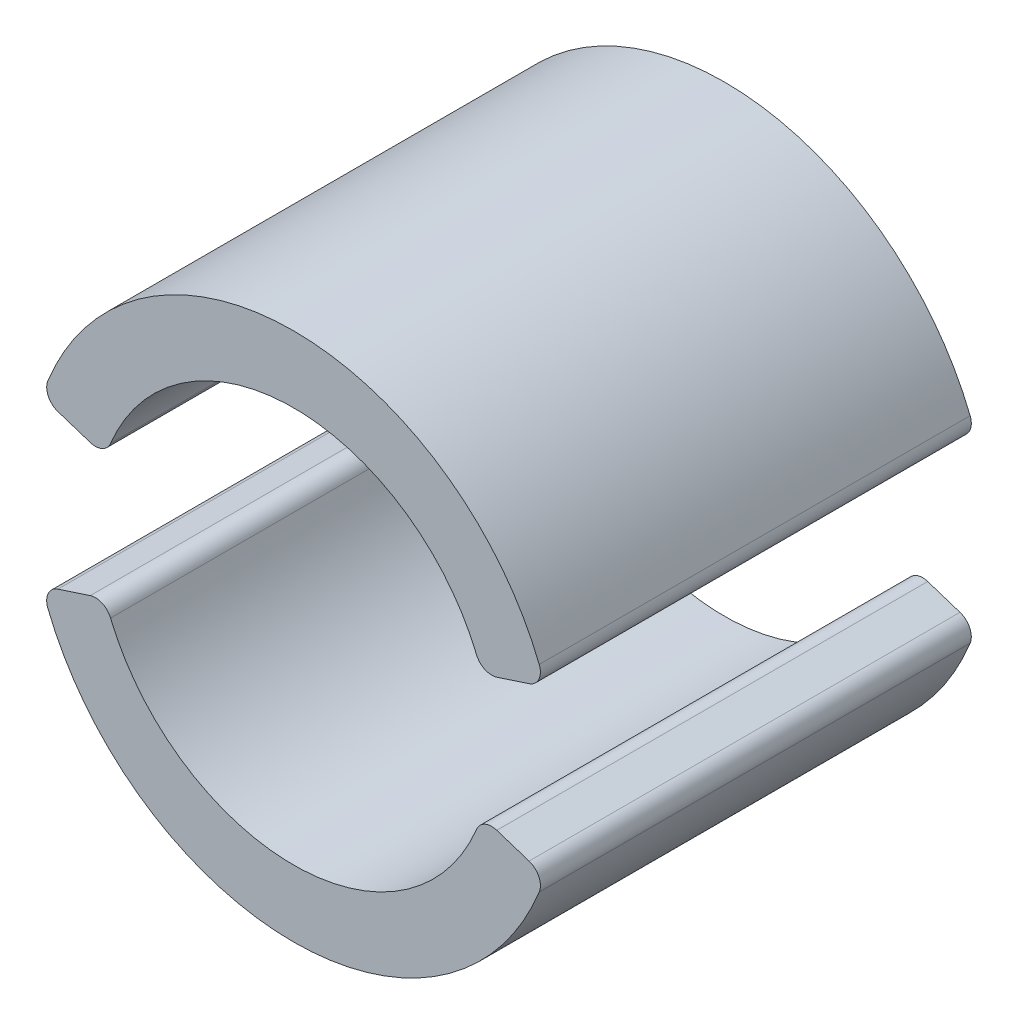
ISO-10303-21;
HEADER;
FILE_DESCRIPTION(('STEP AP214'),'2;1');
FILE_NAME('part.step','',(''),(''),'','','');
FILE_SCHEMA(('AUTOMOTIVE_DESIGN { 1 0 10303 214 1 1 1 1 }'));
ENDSEC;
DATA;
#1=APPLICATION_CONTEXT('core data for automotive mechanical design processes');
#2=APPLICATION_PROTOCOL_DEFINITION('international standard','automotive_design',2000,#1);
#3=PRODUCT_CONTEXT('',#1,'mechanical');
#4=PRODUCT('Part','Part','',(#3));
#5=PRODUCT_RELATED_PRODUCT_CATEGORY('part','',(#4));
#6=PRODUCT_DEFINITION_FORMATION('','',#4);
#7=PRODUCT_DEFINITION_CONTEXT('part definition',#1,'design');
#8=PRODUCT_DEFINITION('design','',#6,#7);
#9=PRODUCT_DEFINITION_SHAPE('','',#8);
#10=(LENGTH_UNIT() NAMED_UNIT(*) SI_UNIT(.MILLI.,.METRE.));
#11=(NAMED_UNIT(*) PLANE_ANGLE_UNIT() SI_UNIT($,.RADIAN.));
#12=(NAMED_UNIT(*) SI_UNIT($,.STERADIAN.) SOLID_ANGLE_UNIT());
#13=UNCERTAINTY_MEASURE_WITH_UNIT(LENGTH_MEASURE(1.E-05),#10,'distance_accuracy_value','');
#14=(GEOMETRIC_REPRESENTATION_CONTEXT(3) GLOBAL_UNCERTAINTY_ASSIGNED_CONTEXT((#13)) GLOBAL_UNIT_ASSIGNED_CONTEXT((#10,
#11,#12)) REPRESENTATION_CONTEXT('',''));
#15=CARTESIAN_POINT('',(0.,0.,0.));
#16=DIRECTION('',(0.,0.,1.));
#17=DIRECTION('',(1.,0.,0.));
#18=AXIS2_PLACEMENT_3D('',#15,#16,#17);
#19=CARTESIAN_POINT('',(14.2625751327977,5.72045798702335,26.67));
#20=DIRECTION('',(0.,0.,-1.));
#21=DIRECTION('',(-1.,0.,0.));
#22=AXIS2_PLACEMENT_3D('',#19,#20,#21);
#23=CYLINDRICAL_SURFACE('',#22,1.016);
#24=CARTESIAN_POINT('',(14.2625751327977,5.72045798702335,0.));
#25=DIRECTION('',(0.,0.,1.));
#26=DIRECTION('',(1.,0.,0.));
#27=AXIS2_PLACEMENT_3D('',#24,#25,#26);
#28=CIRCLE('',#27,1.016);
#29=CARTESIAN_POINT('',(14.5776138924877,4.75453532971944,0.));
#30=VERTEX_POINT('',#29);
#31=CARTESIAN_POINT('',(15.205555306867,6.09867008533894,0.));
#32=VERTEX_POINT('',#31);
#33=EDGE_CURVE('E141',#30,#32,#28,.T.);
#34=ORIENTED_EDGE('',*,*,#33,.T.);
#35=DIRECTION('',(0.,0.,-1.));
#36=VECTOR('',#35,1.);
#37=CARTESIAN_POINT('',(15.205555306867,6.09867008533894,26.67));
#38=LINE('',#37,#36);
#39=CARTESIAN_POINT('',(15.205555306867,6.09867008533894,26.67));
#40=VERTEX_POINT('',#39);
#41=EDGE_CURVE('E12',#40,#32,#38,.T.);
#42=ORIENTED_EDGE('',*,*,#41,.F.);
#43=CARTESIAN_POINT('',(14.2625751327977,5.72045798702335,26.67));
#44=DIRECTION('',(0.,0.,1.));
#45=DIRECTION('',(1.,0.,0.));
#46=AXIS2_PLACEMENT_3D('',#43,#44,#45);
#47=CIRCLE('',#46,1.016);
#48=CARTESIAN_POINT('',(14.5776138924877,4.75453532971944,26.67));
#49=VERTEX_POINT('',#48);
#50=EDGE_CURVE('E155',#49,#40,#47,.T.);
#51=ORIENTED_EDGE('',*,*,#50,.F.);
#52=DIRECTION('',(0.,0.,-1.));
#53=VECTOR('',#52,1.);
#54=CARTESIAN_POINT('',(14.5776138924877,4.75453532971944,26.67));
#55=LINE('',#54,#53);
#56=EDGE_CURVE('E137',#49,#30,#55,.T.);
#57=ORIENTED_EDGE('',*,*,#56,.T.);
#58=EDGE_LOOP('',(#34,#42,#51,#57));
#59=FACE_BOUND('',#58,.T.);
#60=ADVANCED_FACE('F45',(#59),#23,.T.);
#61=CARTESIAN_POINT('',(0.,0.,26.67));
#62=DIRECTION('',(0.,0.,-1.));
#63=DIRECTION('',(-1.,0.,0.));
#64=AXIS2_PLACEMENT_3D('',#61,#62,#63);
#65=CYLINDRICAL_SURFACE('',#64,16.383);
#66=CARTESIAN_POINT('',(0.,0.,0.));
#67=DIRECTION('',(0.,0.,1.));
#68=DIRECTION('',(1.,0.,0.));
#69=AXIS2_PLACEMENT_3D('',#66,#67,#68);
#70=CIRCLE('',#69,16.383);
#71=CARTESIAN_POINT('',(-15.205555306867,6.09867008533894,0.));
#72=VERTEX_POINT('',#71);
#73=EDGE_CURVE('E144',#32,#72,#70,.T.);
#74=ORIENTED_EDGE('',*,*,#73,.T.);
#75=DIRECTION('',(0.,0.,-1.));
#76=VECTOR('',#75,1.);
#77=CARTESIAN_POINT('',(-15.205555306867,6.09867008533894,26.67));
#78=LINE('',#77,#76);
#79=CARTESIAN_POINT('',(-15.205555306867,6.09867008533894,26.67));
#80=VERTEX_POINT('',#79);
#81=EDGE_CURVE('E53',#80,#72,#78,.T.);
#82=ORIENTED_EDGE('',*,*,#81,.F.);
#83=CARTESIAN_POINT('',(0.,0.,26.67));
#84=DIRECTION('',(0.,0.,1.));
#85=DIRECTION('',(1.,0.,0.));
#86=AXIS2_PLACEMENT_3D('',#83,#84,#85);
#87=CIRCLE('',#86,16.383);
#88=EDGE_CURVE('E104',#40,#80,#87,.T.);
#89=ORIENTED_EDGE('',*,*,#88,.F.);
#90=ORIENTED_EDGE('',*,*,#41,.T.);
#91=EDGE_LOOP('',(#74,#82,#89,#90));
#92=FACE_BOUND('',#91,.T.);
#93=ADVANCED_FACE('F190',(#92),#65,.T.);
#94=CARTESIAN_POINT('',(-14.2625751327978,5.72045798702335,26.67));
#95=DIRECTION('',(0.,0.,-1.));
#96=DIRECTION('',(-1.,0.,0.));
#97=AXIS2_PLACEMENT_3D('',#94,#95,#96);
#98=CYLINDRICAL_SURFACE('',#97,1.016);
#99=CARTESIAN_POINT('',(-14.2625751327978,5.72045798702335,0.));
#100=DIRECTION('',(0.,0.,1.));
#101=DIRECTION('',(-1.,0.,0.));
#102=AXIS2_PLACEMENT_3D('',#99,#100,#101);
#103=CIRCLE('',#102,1.016);
#104=CARTESIAN_POINT('',(-14.5776138924877,4.75453532971945,0.));
#105=VERTEX_POINT('',#104);
#106=EDGE_CURVE('E146',#72,#105,#103,.T.);
#107=ORIENTED_EDGE('',*,*,#106,.T.);
#108=DIRECTION('',(0.,0.,-1.));
#109=VECTOR('',#108,1.);
#110=CARTESIAN_POINT('',(-14.5776138924877,4.75453532971945,26.67));
#111=LINE('',#110,#109);
#112=CARTESIAN_POINT('',(-14.5776138924877,4.75453532971945,26.67));
#113=VERTEX_POINT('',#112);
#114=EDGE_CURVE('E162',#113,#105,#111,.T.);
#115=ORIENTED_EDGE('',*,*,#114,.F.);
#116=CARTESIAN_POINT('',(-14.2625751327978,5.72045798702335,26.67));
#117=DIRECTION('',(0.,0.,1.));
#118=DIRECTION('',(-1.,0.,0.));
#119=AXIS2_PLACEMENT_3D('',#116,#117,#118);
#120=CIRCLE('',#119,1.016);
#121=EDGE_CURVE('E170',#80,#113,#120,.T.);
#122=ORIENTED_EDGE('',*,*,#121,.F.);
#123=ORIENTED_EDGE('',*,*,#81,.T.);
#124=EDGE_LOOP('',(#107,#115,#122,#123));
#125=FACE_BOUND('',#124,.T.);
#126=ADVANCED_FACE('F168',(#125),#98,.T.);
#127=CARTESIAN_POINT('',(-12.5803372638141,4.10311717827936,26.67));
#128=DIRECTION('',(0.310077519379845,0.950711276873921,0.));
#129=DIRECTION('',(-0.950711276873921,0.310077519379845,0.));
#130=AXIS2_PLACEMENT_3D('',#127,#128,#129);
#131=PLANE('',#130);
#132=DIRECTION('',(0.950711276873921,-0.310077519379845,0.));
#133=VECTOR('',#132,1.);
#134=CARTESIAN_POINT('',(-12.5803372638141,4.10311717827936,0.));
#135=LINE('',#134,#133);
#136=CARTESIAN_POINT('',(-12.5803372638141,4.10311717827936,0.));
#137=VERTEX_POINT('',#136);
#138=EDGE_CURVE('E148',#105,#137,#135,.T.);
#139=ORIENTED_EDGE('',*,*,#138,.T.);
#140=DIRECTION('',(0.,0.,-1.));
#141=VECTOR('',#140,1.);
#142=CARTESIAN_POINT('',(-12.5803372638141,4.10311717827936,26.67));
#143=LINE('',#142,#141);
#144=CARTESIAN_POINT('',(-12.5803372638141,4.10311717827936,26.67));
#145=VERTEX_POINT('',#144);
#146=EDGE_CURVE('E159',#145,#137,#143,.T.);
#147=ORIENTED_EDGE('',*,*,#146,.F.);
#148=DIRECTION('',(0.950711276873921,-0.310077519379845,0.));
#149=VECTOR('',#148,1.);
#150=CARTESIAN_POINT('',(-12.5803372638141,4.10311717827936,26.67));
#151=LINE('',#150,#149);
#152=EDGE_CURVE('E182',#113,#145,#151,.T.);
#153=ORIENTED_EDGE('',*,*,#152,.F.);
#154=ORIENTED_EDGE('',*,*,#114,.T.);
#155=EDGE_LOOP('',(#139,#147,#153,#154));
#156=FACE_BOUND('',#155,.T.);
#157=ADVANCED_FACE('F178',(#156),#131,.F.);
#158=CARTESIAN_POINT('',(-12.2652985041241,5.06903983558326,26.67));
#159=DIRECTION('',(0.,0.,-1.));
#160=DIRECTION('',(-1.,0.,0.));
#161=AXIS2_PLACEMENT_3D('',#158,#159,#160);
#162=CYLINDRICAL_SURFACE('',#161,1.016);
#163=CARTESIAN_POINT('',(-12.2652985041241,5.06903983558326,0.));
#164=DIRECTION('',(0.,0.,1.));
#165=DIRECTION('',(1.,0.,0.));
#166=AXIS2_PLACEMENT_3D('',#163,#164,#165);
#167=CIRCLE('',#166,1.016);
#168=CARTESIAN_POINT('',(-11.3263282837127,4.68097936970129,0.));
#169=VERTEX_POINT('',#168);
#170=EDGE_CURVE('E150',#137,#169,#167,.T.);
#171=ORIENTED_EDGE('',*,*,#170,.T.);
#172=DIRECTION('',(0.,0.,-1.));
#173=VECTOR('',#172,1.);
#174=CARTESIAN_POINT('',(-11.3263282837127,4.68097936970129,26.67));
#175=LINE('',#174,#173);
#176=CARTESIAN_POINT('',(-11.3263282837127,4.68097936970129,26.67));
#177=VERTEX_POINT('',#176);
#178=EDGE_CURVE('E132',#177,#169,#175,.T.);
#179=ORIENTED_EDGE('',*,*,#178,.F.);
#180=CARTESIAN_POINT('',(-12.2652985041241,5.06903983558326,26.67));
#181=DIRECTION('',(0.,0.,1.));
#182=DIRECTION('',(1.,0.,0.));
#183=AXIS2_PLACEMENT_3D('',#180,#181,#182);
#184=CIRCLE('',#183,1.016);
#185=EDGE_CURVE('E123',#145,#177,#184,.T.);
#186=ORIENTED_EDGE('',*,*,#185,.F.);
#187=ORIENTED_EDGE('',*,*,#146,.T.);
#188=EDGE_LOOP('',(#171,#179,#186,#187));
#189=FACE_BOUND('',#188,.T.);
#190=ADVANCED_FACE('F181',(#189),#162,.T.);
#191=CARTESIAN_POINT('',(0.,0.,26.67));
#192=DIRECTION('',(0.,0.,-1.));
#193=DIRECTION('',(-1.,0.,0.));
#194=AXIS2_PLACEMENT_3D('',#191,#192,#193);
#195=CYLINDRICAL_SURFACE('',#194,12.2555);
#196=CARTESIAN_POINT('',(0.,0.,0.));
#197=DIRECTION('',(0.,0.,-1.));
#198=DIRECTION('',(1.,0.,0.));
#199=AXIS2_PLACEMENT_3D('',#196,#197,#198);
#200=CIRCLE('',#199,12.2555);
#201=CARTESIAN_POINT('',(11.3263282837127,4.68097936970129,0.));
#202=VERTEX_POINT('',#201);
#203=EDGE_CURVE('E131',#169,#202,#200,.T.);
#204=ORIENTED_EDGE('',*,*,#203,.T.);
#205=DIRECTION('',(0.,0.,-1.));
#206=VECTOR('',#205,1.);
#207=CARTESIAN_POINT('',(11.3263282837127,4.68097936970129,26.67));
#208=LINE('',#207,#206);
#209=CARTESIAN_POINT('',(11.3263282837127,4.68097936970129,26.67));
#210=VERTEX_POINT('',#209);
#211=EDGE_CURVE('E128',#210,#202,#208,.T.);
#212=ORIENTED_EDGE('',*,*,#211,.F.);
#213=CARTESIAN_POINT('',(0.,0.,26.67));
#214=DIRECTION('',(0.,0.,-1.));
#215=DIRECTION('',(1.,0.,0.));
#216=AXIS2_PLACEMENT_3D('',#213,#214,#215);
#217=CIRCLE('',#216,12.2555);
#218=EDGE_CURVE('E117',#177,#210,#217,.T.);
#219=ORIENTED_EDGE('',*,*,#218,.F.);
#220=ORIENTED_EDGE('',*,*,#178,.T.);
#221=EDGE_LOOP('',(#204,#212,#219,#220));
#222=FACE_BOUND('',#221,.T.);
#223=ADVANCED_FACE('F129',(#222),#195,.F.);
#224=CARTESIAN_POINT('',(12.2652985041241,5.06903983558326,26.67));
#225=DIRECTION('',(0.,0.,-1.));
#226=DIRECTION('',(-1.,0.,0.));
#227=AXIS2_PLACEMENT_3D('',#224,#225,#226);
#228=CYLINDRICAL_SURFACE('',#227,1.016);
#229=CARTESIAN_POINT('',(12.2652985041241,5.06903983558326,0.));
#230=DIRECTION('',(0.,0.,1.));
#231=DIRECTION('',(-1.,0.,0.));
#232=AXIS2_PLACEMENT_3D('',#229,#230,#231);
#233=CIRCLE('',#232,1.016);
#234=CARTESIAN_POINT('',(12.5803372638141,4.10311717827936,0.));
#235=VERTEX_POINT('',#234);
#236=EDGE_CURVE('E90',#202,#235,#233,.T.);
#237=ORIENTED_EDGE('',*,*,#236,.T.);
#238=DIRECTION('',(0.,0.,-1.));
#239=VECTOR('',#238,1.);
#240=CARTESIAN_POINT('',(12.5803372638141,4.10311717827936,26.67));
#241=LINE('',#240,#239);
#242=CARTESIAN_POINT('',(12.5803372638141,4.10311717827936,26.67));
#243=VERTEX_POINT('',#242);
#244=EDGE_CURVE('E133',#243,#235,#241,.T.);
#245=ORIENTED_EDGE('',*,*,#244,.F.);
#246=CARTESIAN_POINT('',(12.2652985041241,5.06903983558326,26.67));
#247=DIRECTION('',(0.,0.,1.));
#248=DIRECTION('',(-1.,0.,0.));
#249=AXIS2_PLACEMENT_3D('',#246,#247,#248);
#250=CIRCLE('',#249,1.016);
#251=EDGE_CURVE('E121',#210,#243,#250,.T.);
#252=ORIENTED_EDGE('',*,*,#251,.F.);
#253=ORIENTED_EDGE('',*,*,#211,.T.);
#254=EDGE_LOOP('',(#237,#245,#252,#253));
#255=FACE_BOUND('',#254,.T.);
#256=ADVANCED_FACE('F135',(#255),#228,.T.);
#257=CARTESIAN_POINT('',(12.5803372638141,4.10311717827936,26.67));
#258=DIRECTION('',(-0.310077519379845,0.950711276873921,0.));
#259=DIRECTION('',(-0.950711276873922,-0.310077519379845,0.));
#260=AXIS2_PLACEMENT_3D('',#257,#258,#259);
#261=PLANE('',#260);
#262=DIRECTION('',(0.950711276873921,0.310077519379845,0.));
#263=VECTOR('',#262,1.);
#264=CARTESIAN_POINT('',(12.5803372638141,4.10311717827936,0.));
#265=LINE('',#264,#263);
#266=EDGE_CURVE('E96',#235,#30,#265,.T.);
#267=ORIENTED_EDGE('',*,*,#266,.T.);
#268=ORIENTED_EDGE('',*,*,#56,.F.);
#269=DIRECTION('',(0.950711276873921,0.310077519379845,0.));
#270=VECTOR('',#269,1.);
#271=CARTESIAN_POINT('',(12.5803372638141,4.10311717827936,26.67));
#272=LINE('',#271,#270);
#273=EDGE_CURVE('E61',#243,#49,#272,.T.);
#274=ORIENTED_EDGE('',*,*,#273,.F.);
#275=ORIENTED_EDGE('',*,*,#244,.T.);
#276=EDGE_LOOP('',(#267,#268,#274,#275));
#277=FACE_BOUND('',#276,.T.);
#278=ADVANCED_FACE('F206',(#277),#261,.F.);
#279=CARTESIAN_POINT('',(14.2625751327977,5.72045798702335,26.67));
#280=DIRECTION('',(0.,0.,1.));
#281=DIRECTION('',(1.,0.,0.));
#282=AXIS2_PLACEMENT_3D('',#279,#280,#281);
#283=PLANE('',#282);
#284=ORIENTED_EDGE('',*,*,#50,.T.);
#285=ORIENTED_EDGE('',*,*,#88,.T.);
#286=ORIENTED_EDGE('',*,*,#121,.T.);
#287=ORIENTED_EDGE('',*,*,#152,.T.);
#288=ORIENTED_EDGE('',*,*,#185,.T.);
#289=ORIENTED_EDGE('',*,*,#218,.T.);
#290=ORIENTED_EDGE('',*,*,#251,.T.);
#291=ORIENTED_EDGE('',*,*,#273,.T.);
#292=EDGE_LOOP('',(#284,#285,#286,#287,#288,#289,#290,#291));
#293=FACE_BOUND('',#292,.T.);
#294=ADVANCED_FACE('F119',(#293),#283,.T.);
#295=CARTESIAN_POINT('',(14.2625751327977,5.72045798702335,0.));
#296=DIRECTION('',(0.,0.,1.));
#297=DIRECTION('',(1.,0.,0.));
#298=AXIS2_PLACEMENT_3D('',#295,#296,#297);
#299=PLANE('',#298);
#300=ORIENTED_EDGE('',*,*,#33,.F.);
#301=ORIENTED_EDGE('',*,*,#266,.F.);
#302=ORIENTED_EDGE('',*,*,#236,.F.);
#303=ORIENTED_EDGE('',*,*,#203,.F.);
#304=ORIENTED_EDGE('',*,*,#170,.F.);
#305=ORIENTED_EDGE('',*,*,#138,.F.);
#306=ORIENTED_EDGE('',*,*,#106,.F.);
#307=ORIENTED_EDGE('',*,*,#73,.F.);
#308=EDGE_LOOP('',(#300,#301,#302,#303,#304,#305,#306,#307));
#309=FACE_BOUND('',#308,.T.);
#310=ADVANCED_FACE('F174',(#309),#299,.F.);
#311=CLOSED_SHELL('',(#60,#93,#126,#157,#190,#223,#256,#278,#294,#310));
#312=MANIFOLD_SOLID_BREP('B2',#311);
#313=CARTESIAN_POINT('',(-12.2652985041241,-5.06903983558326,26.67));
#314=DIRECTION('',(0.,0.,-1.));
#315=DIRECTION('',(-1.,0.,0.));
#316=AXIS2_PLACEMENT_3D('',#313,#314,#315);
#317=CYLINDRICAL_SURFACE('',#316,1.016);
#318=CARTESIAN_POINT('',(-12.2652985041241,-5.06903983558326,0.));
#319=DIRECTION('',(0.,0.,1.));
#320=DIRECTION('',(1.,0.,0.));
#321=AXIS2_PLACEMENT_3D('',#318,#319,#320);
#322=CIRCLE('',#321,1.016);
#323=CARTESIAN_POINT('',(-11.3263282837127,-4.68097936970129,0.));
#324=VERTEX_POINT('',#323);
#325=CARTESIAN_POINT('',(-12.5803372638141,-4.10311717827936,0.));
#326=VERTEX_POINT('',#325);
#327=EDGE_CURVE('E369',#324,#326,#322,.T.);
#328=ORIENTED_EDGE('',*,*,#327,.T.);
#329=DIRECTION('',(0.,0.,-1.));
#330=VECTOR('',#329,1.);
#331=CARTESIAN_POINT('',(-12.5803372638141,-4.10311717827936,26.67));
#332=LINE('',#331,#330);
#333=CARTESIAN_POINT('',(-12.5803372638141,-4.10311717827936,26.67));
#334=VERTEX_POINT('',#333);
#335=EDGE_CURVE('E43',#334,#326,#332,.T.);
#336=ORIENTED_EDGE('',*,*,#335,.F.);
#337=CARTESIAN_POINT('',(-12.2652985041241,-5.06903983558326,26.67));
#338=DIRECTION('',(0.,0.,1.));
#339=DIRECTION('',(1.,0.,0.));
#340=AXIS2_PLACEMENT_3D('',#337,#338,#339);
#341=CIRCLE('',#340,1.016);
#342=CARTESIAN_POINT('',(-11.3263282837127,-4.68097936970129,26.67));
#343=VERTEX_POINT('',#342);
#344=EDGE_CURVE('E383',#343,#334,#341,.T.);
#345=ORIENTED_EDGE('',*,*,#344,.F.);
#346=DIRECTION('',(0.,0.,-1.));
#347=VECTOR('',#346,1.);
#348=CARTESIAN_POINT('',(-11.3263282837127,-4.68097936970129,26.67));
#349=LINE('',#348,#347);
#350=EDGE_CURVE('E365',#343,#324,#349,.T.);
#351=ORIENTED_EDGE('',*,*,#350,.T.);
#352=EDGE_LOOP('',(#328,#336,#345,#351));
#353=FACE_BOUND('',#352,.T.);
#354=ADVANCED_FACE('F273',(#353),#317,.T.);
#355=CARTESIAN_POINT('',(-12.5803372638141,-4.10311717827936,26.67));
#356=DIRECTION('',(0.310077519379845,-0.950711276873921,0.));
#357=DIRECTION('',(0.950711276873921,0.310077519379845,0.));
#358=AXIS2_PLACEMENT_3D('',#355,#356,#357);
#359=PLANE('',#358);
#360=DIRECTION('',(-0.950711276873921,-0.310077519379845,0.));
#361=VECTOR('',#360,1.);
#362=CARTESIAN_POINT('',(-12.5803372638141,-4.10311717827936,0.));
#363=LINE('',#362,#361);
#364=CARTESIAN_POINT('',(-14.5776138924877,-4.75453532971945,0.));
#365=VERTEX_POINT('',#364);
#366=EDGE_CURVE('E372',#326,#365,#363,.T.);
#367=ORIENTED_EDGE('',*,*,#366,.T.);
#368=DIRECTION('',(0.,0.,-1.));
#369=VECTOR('',#368,1.);
#370=CARTESIAN_POINT('',(-14.5776138924877,-4.75453532971945,26.67));
#371=LINE('',#370,#369);
#372=CARTESIAN_POINT('',(-14.5776138924877,-4.75453532971945,26.67));
#373=VERTEX_POINT('',#372);
#374=EDGE_CURVE('E281',#373,#365,#371,.T.);
#375=ORIENTED_EDGE('',*,*,#374,.F.);
#376=DIRECTION('',(-0.950711276873921,-0.310077519379845,0.));
#377=VECTOR('',#376,1.);
#378=CARTESIAN_POINT('',(-12.5803372638141,-4.10311717827936,26.67));
#379=LINE('',#378,#377);
#380=EDGE_CURVE('E332',#334,#373,#379,.T.);
#381=ORIENTED_EDGE('',*,*,#380,.F.);
#382=ORIENTED_EDGE('',*,*,#335,.T.);
#383=EDGE_LOOP('',(#367,#375,#381,#382));
#384=FACE_BOUND('',#383,.T.);
#385=ADVANCED_FACE('F418',(#384),#359,.F.);
#386=CARTESIAN_POINT('',(-14.2625751327978,-5.72045798702335,26.67));
#387=DIRECTION('',(0.,0.,-1.));
#388=DIRECTION('',(-1.,0.,0.));
#389=AXIS2_PLACEMENT_3D('',#386,#387,#388);
#390=CYLINDRICAL_SURFACE('',#389,1.016);
#391=CARTESIAN_POINT('',(-14.2625751327978,-5.72045798702335,0.));
#392=DIRECTION('',(0.,0.,1.));
#393=DIRECTION('',(1.,0.,0.));
#394=AXIS2_PLACEMENT_3D('',#391,#392,#393);
#395=CIRCLE('',#394,1.016);
#396=CARTESIAN_POINT('',(-15.205555306867,-6.09867008533894,0.));
#397=VERTEX_POINT('',#396);
#398=EDGE_CURVE('E374',#365,#397,#395,.T.);
#399=ORIENTED_EDGE('',*,*,#398,.T.);
#400=DIRECTION('',(0.,0.,-1.));
#401=VECTOR('',#400,1.);
#402=CARTESIAN_POINT('',(-15.205555306867,-6.09867008533894,26.67));
#403=LINE('',#402,#401);
#404=CARTESIAN_POINT('',(-15.205555306867,-6.09867008533894,26.67));
#405=VERTEX_POINT('',#404);
#406=EDGE_CURVE('E390',#405,#397,#403,.T.);
#407=ORIENTED_EDGE('',*,*,#406,.F.);
#408=CARTESIAN_POINT('',(-14.2625751327978,-5.72045798702335,26.67));
#409=DIRECTION('',(0.,0.,1.));
#410=DIRECTION('',(1.,0.,0.));
#411=AXIS2_PLACEMENT_3D('',#408,#409,#410);
#412=CIRCLE('',#411,1.016);
#413=EDGE_CURVE('E398',#373,#405,#412,.T.);
#414=ORIENTED_EDGE('',*,*,#413,.F.);
#415=ORIENTED_EDGE('',*,*,#374,.T.);
#416=EDGE_LOOP('',(#399,#407,#414,#415));
#417=FACE_BOUND('',#416,.T.);
#418=ADVANCED_FACE('F396',(#417),#390,.T.);
#419=CARTESIAN_POINT('',(0.,0.,26.67));
#420=DIRECTION('',(0.,0.,-1.));
#421=DIRECTION('',(-1.,0.,0.));
#422=AXIS2_PLACEMENT_3D('',#419,#420,#421);
#423=CYLINDRICAL_SURFACE('',#422,16.383);
#424=CARTESIAN_POINT('',(0.,0.,0.));
#425=DIRECTION('',(0.,0.,1.));
#426=DIRECTION('',(1.,0.,0.));
#427=AXIS2_PLACEMENT_3D('',#424,#425,#426);
#428=CIRCLE('',#427,16.383);
#429=CARTESIAN_POINT('',(15.205555306867,-6.09867008533894,0.));
#430=VERTEX_POINT('',#429);
#431=EDGE_CURVE('E376',#397,#430,#428,.T.);
#432=ORIENTED_EDGE('',*,*,#431,.T.);
#433=DIRECTION('',(0.,0.,-1.));
#434=VECTOR('',#433,1.);
#435=CARTESIAN_POINT('',(15.205555306867,-6.09867008533894,26.67));
#436=LINE('',#435,#434);
#437=CARTESIAN_POINT('',(15.205555306867,-6.09867008533894,26.67));
#438=VERTEX_POINT('',#437);
#439=EDGE_CURVE('E387',#438,#430,#436,.T.);
#440=ORIENTED_EDGE('',*,*,#439,.F.);
#441=CARTESIAN_POINT('',(0.,0.,26.67));
#442=DIRECTION('',(0.,0.,1.));
#443=DIRECTION('',(1.,0.,0.));
#444=AXIS2_PLACEMENT_3D('',#441,#442,#443);
#445=CIRCLE('',#444,16.383);
#446=EDGE_CURVE('E410',#405,#438,#445,.T.);
#447=ORIENTED_EDGE('',*,*,#446,.F.);
#448=ORIENTED_EDGE('',*,*,#406,.T.);
#449=EDGE_LOOP('',(#432,#440,#447,#448));
#450=FACE_BOUND('',#449,.T.);
#451=ADVANCED_FACE('F406',(#450),#423,.T.);
#452=CARTESIAN_POINT('',(14.2625751327977,-5.72045798702335,26.67));
#453=DIRECTION('',(0.,0.,-1.));
#454=DIRECTION('',(-1.,0.,0.));
#455=AXIS2_PLACEMENT_3D('',#452,#453,#454);
#456=CYLINDRICAL_SURFACE('',#455,1.016);
#457=CARTESIAN_POINT('',(14.2625751327977,-5.72045798702335,0.));
#458=DIRECTION('',(0.,0.,1.));
#459=DIRECTION('',(-1.,0.,0.));
#460=AXIS2_PLACEMENT_3D('',#457,#458,#459);
#461=CIRCLE('',#460,1.016);
#462=CARTESIAN_POINT('',(14.5776138924877,-4.75453532971944,0.));
#463=VERTEX_POINT('',#462);
#464=EDGE_CURVE('E378',#430,#463,#461,.T.);
#465=ORIENTED_EDGE('',*,*,#464,.T.);
#466=DIRECTION('',(0.,0.,-1.));
#467=VECTOR('',#466,1.);
#468=CARTESIAN_POINT('',(14.5776138924877,-4.75453532971944,26.67));
#469=LINE('',#468,#467);
#470=CARTESIAN_POINT('',(14.5776138924877,-4.75453532971944,26.67));
#471=VERTEX_POINT('',#470);
#472=EDGE_CURVE('E360',#471,#463,#469,.T.);
#473=ORIENTED_EDGE('',*,*,#472,.F.);
#474=CARTESIAN_POINT('',(14.2625751327977,-5.72045798702335,26.67));
#475=DIRECTION('',(0.,0.,1.));
#476=DIRECTION('',(-1.,0.,0.));
#477=AXIS2_PLACEMENT_3D('',#474,#475,#476);
#478=CIRCLE('',#477,1.016);
#479=EDGE_CURVE('E351',#438,#471,#478,.T.);
#480=ORIENTED_EDGE('',*,*,#479,.F.);
#481=ORIENTED_EDGE('',*,*,#439,.T.);
#482=EDGE_LOOP('',(#465,#473,#480,#481));
#483=FACE_BOUND('',#482,.T.);
#484=ADVANCED_FACE('F409',(#483),#456,.T.);
#485=CARTESIAN_POINT('',(12.5803372638141,-4.10311717827936,26.67));
#486=DIRECTION('',(-0.310077519379845,-0.950711276873921,0.));
#487=DIRECTION('',(0.950711276873922,-0.310077519379845,0.));
#488=AXIS2_PLACEMENT_3D('',#485,#486,#487);
#489=PLANE('',#488);
#490=DIRECTION('',(-0.950711276873921,0.310077519379845,0.));
#491=VECTOR('',#490,1.);
#492=CARTESIAN_POINT('',(12.5803372638141,-4.10311717827936,0.));
#493=LINE('',#492,#491);
#494=CARTESIAN_POINT('',(12.5803372638141,-4.10311717827936,0.));
#495=VERTEX_POINT('',#494);
#496=EDGE_CURVE('E359',#463,#495,#493,.T.);
#497=ORIENTED_EDGE('',*,*,#496,.T.);
#498=DIRECTION('',(0.,0.,-1.));
#499=VECTOR('',#498,1.);
#500=CARTESIAN_POINT('',(12.5803372638141,-4.10311717827936,26.67));
#501=LINE('',#500,#499);
#502=CARTESIAN_POINT('',(12.5803372638141,-4.10311717827936,26.67));
#503=VERTEX_POINT('',#502);
#504=EDGE_CURVE('E356',#503,#495,#501,.T.);
#505=ORIENTED_EDGE('',*,*,#504,.F.);
#506=DIRECTION('',(-0.950711276873921,0.310077519379845,0.));
#507=VECTOR('',#506,1.);
#508=CARTESIAN_POINT('',(12.5803372638141,-4.10311717827936,26.67));
#509=LINE('',#508,#507);
#510=EDGE_CURVE('E345',#471,#503,#509,.T.);
#511=ORIENTED_EDGE('',*,*,#510,.F.);
#512=ORIENTED_EDGE('',*,*,#472,.T.);
#513=EDGE_LOOP('',(#497,#505,#511,#512));
#514=FACE_BOUND('',#513,.T.);
#515=ADVANCED_FACE('F357',(#514),#489,.F.);
#516=CARTESIAN_POINT('',(12.2652985041241,-5.06903983558326,26.67));
#517=DIRECTION('',(0.,0.,-1.));
#518=DIRECTION('',(-1.,0.,0.));
#519=AXIS2_PLACEMENT_3D('',#516,#517,#518);
#520=CYLINDRICAL_SURFACE('',#519,1.016);
#521=CARTESIAN_POINT('',(12.2652985041241,-5.06903983558326,0.));
#522=DIRECTION('',(0.,0.,1.));
#523=DIRECTION('',(1.,0.,0.));
#524=AXIS2_PLACEMENT_3D('',#521,#522,#523);
#525=CIRCLE('',#524,1.016);
#526=CARTESIAN_POINT('',(11.3263282837127,-4.6809793697013,0.));
#527=VERTEX_POINT('',#526);
#528=EDGE_CURVE('E318',#495,#527,#525,.T.);
#529=ORIENTED_EDGE('',*,*,#528,.T.);
#530=DIRECTION('',(0.,0.,-1.));
#531=VECTOR('',#530,1.);
#532=CARTESIAN_POINT('',(11.3263282837127,-4.6809793697013,26.67));
#533=LINE('',#532,#531);
#534=CARTESIAN_POINT('',(11.3263282837127,-4.6809793697013,26.67));
#535=VERTEX_POINT('',#534);
#536=EDGE_CURVE('E361',#535,#527,#533,.T.);
#537=ORIENTED_EDGE('',*,*,#536,.F.);
#538=CARTESIAN_POINT('',(12.2652985041241,-5.06903983558326,26.67));
#539=DIRECTION('',(0.,0.,1.));
#540=DIRECTION('',(1.,0.,0.));
#541=AXIS2_PLACEMENT_3D('',#538,#539,#540);
#542=CIRCLE('',#541,1.016);
#543=EDGE_CURVE('E349',#503,#535,#542,.T.);
#544=ORIENTED_EDGE('',*,*,#543,.F.);
#545=ORIENTED_EDGE('',*,*,#504,.T.);
#546=EDGE_LOOP('',(#529,#537,#544,#545));
#547=FACE_BOUND('',#546,.T.);
#548=ADVANCED_FACE('F363',(#547),#520,.T.);
#549=CARTESIAN_POINT('',(0.,0.,26.67));
#550=DIRECTION('',(0.,0.,-1.));
#551=DIRECTION('',(-1.,0.,0.));
#552=AXIS2_PLACEMENT_3D('',#549,#550,#551);
#553=CYLINDRICAL_SURFACE('',#552,12.2555);
#554=CARTESIAN_POINT('',(0.,0.,0.));
#555=DIRECTION('',(0.,0.,-1.));
#556=DIRECTION('',(1.,0.,0.));
#557=AXIS2_PLACEMENT_3D('',#554,#555,#556);
#558=CIRCLE('',#557,12.2555);
#559=EDGE_CURVE('E324',#527,#324,#558,.T.);
#560=ORIENTED_EDGE('',*,*,#559,.T.);
#561=ORIENTED_EDGE('',*,*,#350,.F.);
#562=CARTESIAN_POINT('',(0.,0.,26.67));
#563=DIRECTION('',(0.,0.,-1.));
#564=DIRECTION('',(1.,0.,0.));
#565=AXIS2_PLACEMENT_3D('',#562,#563,#564);
#566=CIRCLE('',#565,12.2555);
#567=EDGE_CURVE('E289',#535,#343,#566,.T.);
#568=ORIENTED_EDGE('',*,*,#567,.F.);
#569=ORIENTED_EDGE('',*,*,#536,.T.);
#570=EDGE_LOOP('',(#560,#561,#568,#569));
#571=FACE_BOUND('',#570,.T.);
#572=ADVANCED_FACE('F434',(#571),#553,.F.);
#573=CARTESIAN_POINT('',(-12.2652985041241,-5.06903983558326,26.67));
#574=DIRECTION('',(0.,0.,1.));
#575=DIRECTION('',(1.,0.,0.));
#576=AXIS2_PLACEMENT_3D('',#573,#574,#575);
#577=PLANE('',#576);
#578=ORIENTED_EDGE('',*,*,#344,.T.);
#579=ORIENTED_EDGE('',*,*,#380,.T.);
#580=ORIENTED_EDGE('',*,*,#413,.T.);
#581=ORIENTED_EDGE('',*,*,#446,.T.);
#582=ORIENTED_EDGE('',*,*,#479,.T.);
#583=ORIENTED_EDGE('',*,*,#510,.T.);
#584=ORIENTED_EDGE('',*,*,#543,.T.);
#585=ORIENTED_EDGE('',*,*,#567,.T.);
#586=EDGE_LOOP('',(#578,#579,#580,#581,#582,#583,#584,#585));
#587=FACE_BOUND('',#586,.T.);
#588=ADVANCED_FACE('F347',(#587),#577,.T.);
#589=CARTESIAN_POINT('',(-12.2652985041241,-5.06903983558326,0.));
#590=DIRECTION('',(0.,0.,1.));
#591=DIRECTION('',(1.,0.,0.));
#592=AXIS2_PLACEMENT_3D('',#589,#590,#591);
#593=PLANE('',#592);
#594=ORIENTED_EDGE('',*,*,#327,.F.);
#595=ORIENTED_EDGE('',*,*,#559,.F.);
#596=ORIENTED_EDGE('',*,*,#528,.F.);
#597=ORIENTED_EDGE('',*,*,#496,.F.);
#598=ORIENTED_EDGE('',*,*,#464,.F.);
#599=ORIENTED_EDGE('',*,*,#431,.F.);
#600=ORIENTED_EDGE('',*,*,#398,.F.);
#601=ORIENTED_EDGE('',*,*,#366,.F.);
#602=EDGE_LOOP('',(#594,#595,#596,#597,#598,#599,#600,#601));
#603=FACE_BOUND('',#602,.T.);
#604=ADVANCED_FACE('F402',(#603),#593,.F.);
#605=CLOSED_SHELL('',(#354,#385,#418,#451,#484,#515,#548,#572,#588,#604));
#606=MANIFOLD_SOLID_BREP('B6',#605);
#607=ADVANCED_BREP_SHAPE_REPRESENTATION('',(#18,#312,#606),#14);
#608=SHAPE_DEFINITION_REPRESENTATION(#9,#607);
ENDSEC;
END-ISO-10303-21;
